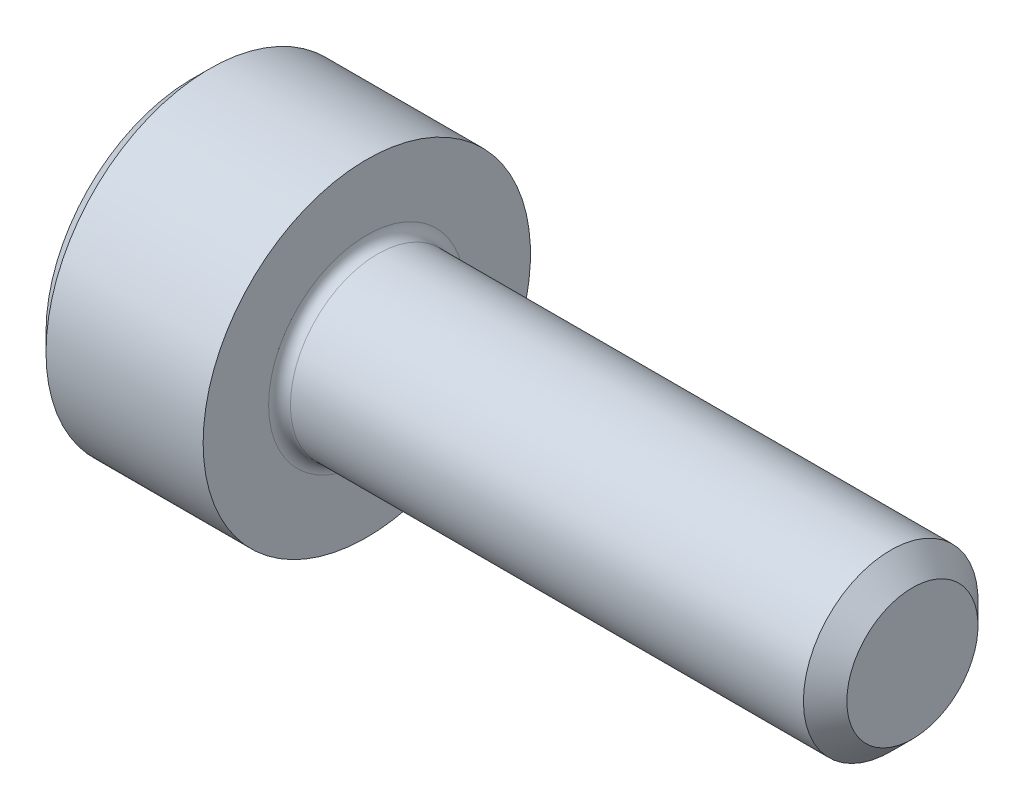
ISO-10303-21;
HEADER;
FILE_DESCRIPTION(('STEP AP214'),'2;1');
FILE_NAME('part.step','',(''),(''),'','','');
FILE_SCHEMA(('AUTOMOTIVE_DESIGN { 1 0 10303 214 1 1 1 1 }'));
ENDSEC;
DATA;
#1=APPLICATION_CONTEXT('core data for automotive mechanical design processes');
#2=APPLICATION_PROTOCOL_DEFINITION('international standard','automotive_design',2000,#1);
#3=PRODUCT_CONTEXT('',#1,'mechanical');
#4=PRODUCT('Part','Part','',(#3));
#5=PRODUCT_RELATED_PRODUCT_CATEGORY('part','',(#4));
#6=PRODUCT_DEFINITION_FORMATION('','',#4);
#7=PRODUCT_DEFINITION_CONTEXT('part definition',#1,'design');
#8=PRODUCT_DEFINITION('design','',#6,#7);
#9=PRODUCT_DEFINITION_SHAPE('','',#8);
#10=(LENGTH_UNIT() NAMED_UNIT(*) SI_UNIT(.MILLI.,.METRE.));
#11=(NAMED_UNIT(*) PLANE_ANGLE_UNIT() SI_UNIT($,.RADIAN.));
#12=(NAMED_UNIT(*) SI_UNIT($,.STERADIAN.) SOLID_ANGLE_UNIT());
#13=UNCERTAINTY_MEASURE_WITH_UNIT(LENGTH_MEASURE(1.E-05),#10,'distance_accuracy_value','');
#14=(GEOMETRIC_REPRESENTATION_CONTEXT(3) GLOBAL_UNCERTAINTY_ASSIGNED_CONTEXT((#13)) GLOBAL_UNIT_ASSIGNED_CONTEXT((#10,
#11,#12)) REPRESENTATION_CONTEXT('',''));
#15=CARTESIAN_POINT('',(0.,0.,0.));
#16=DIRECTION('',(0.,0.,1.));
#17=DIRECTION('',(1.,0.,0.));
#18=AXIS2_PLACEMENT_3D('',#15,#16,#17);
#19=CARTESIAN_POINT('',(0.,0.,0.));
#20=DIRECTION('',(-1.,0.,0.));
#21=DIRECTION('',(0.,0.,1.));
#22=AXIS2_PLACEMENT_3D('',#19,#20,#21);
#23=PLANE('',#22);
#24=DIRECTION('',(0.,-0.499999999999999,0.866025403784439));
#25=VECTOR('',#24,1.);
#26=CARTESIAN_POINT('',(0.,0.892006165897969,0.));
#27=LINE('',#26,#25);
#28=CARTESIAN_POINT('',(0.,0.892006165897969,0.));
#29=VERTEX_POINT('',#28);
#30=CARTESIAN_POINT('',(0.,0.446003082948983,0.772499999999997));
#31=VERTEX_POINT('',#30);
#32=EDGE_CURVE('E257',#29,#31,#27,.T.);
#33=ORIENTED_EDGE('',*,*,#32,.T.);
#34=DIRECTION('',(0.,1.,0.));
#35=VECTOR('',#34,1.);
#36=CARTESIAN_POINT('',(0.,-0.446003082948989,0.772499999999998));
#37=LINE('',#36,#35);
#38=CARTESIAN_POINT('',(0.,-0.446003082948989,0.772499999999998));
#39=VERTEX_POINT('',#38);
#40=EDGE_CURVE('E128',#39,#31,#37,.T.);
#41=ORIENTED_EDGE('',*,*,#40,.F.);
#42=DIRECTION('',(0.,-0.500000000000001,-0.866025403784438));
#43=VECTOR('',#42,1.);
#44=CARTESIAN_POINT('',(0.,-0.446003082948989,0.772499999999998));
#45=LINE('',#44,#43);
#46=CARTESIAN_POINT('',(0.,-0.892006165897975,0.));
#47=VERTEX_POINT('',#46);
#48=EDGE_CURVE('E260',#39,#47,#45,.T.);
#49=ORIENTED_EDGE('',*,*,#48,.T.);
#50=DIRECTION('',(0.,0.499999999999999,-0.866025403784439));
#51=VECTOR('',#50,1.);
#52=CARTESIAN_POINT('',(0.,-0.892006165897975,0.));
#53=LINE('',#52,#51);
#54=CARTESIAN_POINT('',(0.,-0.44600308294899,-0.772500000000001));
#55=VERTEX_POINT('',#54);
#56=EDGE_CURVE('E263',#47,#55,#53,.T.);
#57=ORIENTED_EDGE('',*,*,#56,.T.);
#58=DIRECTION('',(0.,-1.,0.));
#59=VECTOR('',#58,1.);
#60=CARTESIAN_POINT('',(0.,0.446003082948982,-0.772500000000003));
#61=LINE('',#60,#59);
#62=CARTESIAN_POINT('',(0.,0.446003082948982,-0.772500000000003));
#63=VERTEX_POINT('',#62);
#64=EDGE_CURVE('E266',#63,#55,#61,.T.);
#65=ORIENTED_EDGE('',*,*,#64,.F.);
#66=DIRECTION('',(0.,-0.500000000000001,-0.866025403784438));
#67=VECTOR('',#66,1.);
#68=CARTESIAN_POINT('',(0.,0.892006165897969,0.));
#69=LINE('',#68,#67);
#70=EDGE_CURVE('E123',#29,#63,#69,.T.);
#71=ORIENTED_EDGE('',*,*,#70,.F.);
#72=EDGE_LOOP('',(#33,#41,#49,#57,#65,#71));
#73=FACE_BOUND('',#72,.T.);
#74=CARTESIAN_POINT('',(0.,0.,0.));
#75=DIRECTION('',(-1.,0.,0.));
#76=DIRECTION('',(0.,0.,1.));
#77=AXIS2_PLACEMENT_3D('',#74,#75,#76);
#78=CIRCLE('',#77,1.34000000000001);
#79=CARTESIAN_POINT('',(0.,0.,1.34000000000001));
#80=VERTEX_POINT('',#79);
#81=EDGE_CURVE('E152',#80,#80,#78,.T.);
#82=ORIENTED_EDGE('',*,*,#81,.T.);
#83=EDGE_LOOP('',(#82));
#84=FACE_BOUND('',#83,.T.);
#85=ADVANCED_FACE('F32',(#73,#84),#23,.T.);
#86=CARTESIAN_POINT('',(0.,0.,0.));
#87=DIRECTION('',(1.,0.,0.));
#88=DIRECTION('',(0.,0.,-1.));
#89=AXIS2_PLACEMENT_3D('',#86,#87,#88);
#90=CONICAL_SURFACE('',#89,1.34000000000001,0.7853981633974);
#91=CARTESIAN_POINT('',(0.16,0.,0.));
#92=DIRECTION('',(-1.,0.,0.));
#93=DIRECTION('',(0.,0.,1.));
#94=AXIS2_PLACEMENT_3D('',#91,#92,#93);
#95=CIRCLE('',#94,1.5);
#96=CARTESIAN_POINT('',(0.16,0.,1.5));
#97=VERTEX_POINT('',#96);
#98=EDGE_CURVE('E149',#97,#97,#95,.T.);
#99=ORIENTED_EDGE('',*,*,#98,.T.);
#100=EDGE_LOOP('',(#99));
#101=FACE_BOUND('',#100,.T.);
#102=ORIENTED_EDGE('',*,*,#81,.F.);
#103=EDGE_LOOP('',(#102));
#104=FACE_BOUND('',#103,.T.);
#105=ADVANCED_FACE('F173',(#101,#104),#90,.T.);
#106=CARTESIAN_POINT('',(-31.75,0.,0.));
#107=DIRECTION('',(-1.,0.,0.));
#108=DIRECTION('',(0.,0.,1.));
#109=AXIS2_PLACEMENT_3D('',#106,#107,#108);
#110=CYLINDRICAL_SURFACE('',#109,1.5);
#111=CARTESIAN_POINT('',(1.6,0.,0.));
#112=DIRECTION('',(-1.,0.,0.));
#113=DIRECTION('',(0.,0.,1.));
#114=AXIS2_PLACEMENT_3D('',#111,#112,#113);
#115=CIRCLE('',#114,1.5);
#116=CARTESIAN_POINT('',(1.6,0.,1.5));
#117=VERTEX_POINT('',#116);
#118=EDGE_CURVE('E146',#117,#117,#115,.T.);
#119=ORIENTED_EDGE('',*,*,#118,.T.);
#120=EDGE_LOOP('',(#119));
#121=FACE_BOUND('',#120,.T.);
#122=ORIENTED_EDGE('',*,*,#98,.F.);
#123=EDGE_LOOP('',(#122));
#124=FACE_BOUND('',#123,.T.);
#125=ADVANCED_FACE('F178',(#121,#124),#110,.T.);
#126=CARTESIAN_POINT('',(1.6,1.5,0.));
#127=DIRECTION('',(1.,0.,0.));
#128=DIRECTION('',(0.,0.,-1.));
#129=AXIS2_PLACEMENT_3D('',#126,#127,#128);
#130=PLANE('',#129);
#131=CARTESIAN_POINT('',(1.6,0.,0.));
#132=DIRECTION('',(1.,0.,0.));
#133=DIRECTION('',(0.,0.,-1.));
#134=AXIS2_PLACEMENT_3D('',#131,#132,#133);
#135=CIRCLE('',#134,0.900000000000002);
#136=CARTESIAN_POINT('',(1.6,0.,-0.900000000000002));
#137=VERTEX_POINT('',#136);
#138=EDGE_CURVE('E40',#137,#137,#135,.F.);
#139=ORIENTED_EDGE('',*,*,#138,.T.);
#140=EDGE_LOOP('',(#139));
#141=FACE_BOUND('',#140,.T.);
#142=ORIENTED_EDGE('',*,*,#118,.F.);
#143=EDGE_LOOP('',(#142));
#144=FACE_BOUND('',#143,.T.);
#145=ADVANCED_FACE('F157',(#141,#144),#130,.T.);
#146=CARTESIAN_POINT('',(-31.75,0.,0.));
#147=DIRECTION('',(-1.,0.,0.));
#148=DIRECTION('',(0.,0.,1.));
#149=AXIS2_PLACEMENT_3D('',#146,#147,#148);
#150=CYLINDRICAL_SURFACE('',#149,0.800000000000002);
#151=CARTESIAN_POINT('',(1.7,0.,0.));
#152=DIRECTION('',(1.,0.,0.));
#153=DIRECTION('',(0.,0.,-1.));
#154=AXIS2_PLACEMENT_3D('',#151,#152,#153);
#155=CIRCLE('',#154,0.800000000000002);
#156=CARTESIAN_POINT('',(1.7,0.,-0.800000000000002));
#157=VERTEX_POINT('',#156);
#158=EDGE_CURVE('E11',#157,#157,#155,.T.);
#159=ORIENTED_EDGE('',*,*,#158,.T.);
#160=EDGE_LOOP('',(#159));
#161=FACE_BOUND('',#160,.T.);
#162=CARTESIAN_POINT('',(6.401,0.,0.));
#163=DIRECTION('',(-1.,0.,0.));
#164=DIRECTION('',(0.,0.,1.));
#165=AXIS2_PLACEMENT_3D('',#162,#163,#164);
#166=CIRCLE('',#165,0.800000000000002);
#167=CARTESIAN_POINT('',(6.401,0.,0.800000000000002));
#168=VERTEX_POINT('',#167);
#169=EDGE_CURVE('E143',#168,#168,#166,.T.);
#170=ORIENTED_EDGE('',*,*,#169,.T.);
#171=EDGE_LOOP('',(#170));
#172=FACE_BOUND('',#171,.T.);
#173=ADVANCED_FACE('F188',(#161,#172),#150,.T.);
#174=CARTESIAN_POINT('',(6.59999999999999,0.,0.));
#175=DIRECTION('',(-1.,0.,0.));
#176=DIRECTION('',(0.,0.,1.));
#177=AXIS2_PLACEMENT_3D('',#174,#175,#176);
#178=CONICAL_SURFACE('',#177,0.601000000000001,0.785398163397474);
#179=ORIENTED_EDGE('',*,*,#169,.F.);
#180=EDGE_LOOP('',(#179));
#181=FACE_BOUND('',#180,.T.);
#182=CARTESIAN_POINT('',(6.59999999999999,0.,0.));
#183=DIRECTION('',(-1.,0.,0.));
#184=DIRECTION('',(0.,0.,1.));
#185=AXIS2_PLACEMENT_3D('',#182,#183,#184);
#186=CIRCLE('',#185,0.601000000000001);
#187=CARTESIAN_POINT('',(6.59999999999999,0.,0.601000000000001));
#188=VERTEX_POINT('',#187);
#189=EDGE_CURVE('E139',#188,#188,#186,.T.);
#190=ORIENTED_EDGE('',*,*,#189,.T.);
#191=EDGE_LOOP('',(#190));
#192=FACE_BOUND('',#191,.T.);
#193=ADVANCED_FACE('F168',(#181,#192),#178,.T.);
#194=CARTESIAN_POINT('',(6.59999999999999,0.601000000000001,0.));
#195=DIRECTION('',(1.,0.,0.));
#196=DIRECTION('',(0.,0.,-1.));
#197=AXIS2_PLACEMENT_3D('',#194,#195,#196);
#198=PLANE('',#197);
#199=ORIENTED_EDGE('',*,*,#189,.F.);
#200=EDGE_LOOP('',(#199));
#201=FACE_BOUND('',#200,.T.);
#202=ADVANCED_FACE('F161',(#201),#198,.T.);
#203=CARTESIAN_POINT('',(1.7,0.,0.));
#204=DIRECTION('',(1.,0.,0.));
#205=DIRECTION('',(0.,0.,-1.));
#206=AXIS2_PLACEMENT_3D('',#203,#204,#205);
#207=TOROIDAL_SURFACE('',#206,0.900000000000002,0.1);
#208=ORIENTED_EDGE('',*,*,#158,.F.);
#209=EDGE_LOOP('',(#208));
#210=FACE_BOUND('',#209,.T.);
#211=ORIENTED_EDGE('',*,*,#138,.F.);
#212=EDGE_LOOP('',(#211));
#213=FACE_BOUND('',#212,.T.);
#214=ADVANCED_FACE('F34',(#210,#213),#207,.F.);
#215=CARTESIAN_POINT('',(0.7,0.892006165897969,0.));
#216=DIRECTION('',(0.,-0.866025403784439,-0.499999999999999));
#217=DIRECTION('',(0.,0.499999999999999,-0.866025403784439));
#218=AXIS2_PLACEMENT_3D('',#215,#216,#217);
#219=PLANE('',#218);
#220=ORIENTED_EDGE('',*,*,#32,.F.);
#221=DIRECTION('',(-1.,0.,0.));
#222=VECTOR('',#221,1.);
#223=CARTESIAN_POINT('',(0.7,0.892006165897969,0.));
#224=LINE('',#223,#222);
#225=CARTESIAN_POINT('',(0.7,0.892006165897969,0.));
#226=VERTEX_POINT('',#225);
#227=EDGE_CURVE('E247',#226,#29,#224,.T.);
#228=ORIENTED_EDGE('',*,*,#227,.F.);
#229=DIRECTION('',(0.,-0.499999999999999,0.866025403784439));
#230=VECTOR('',#229,1.);
#231=CARTESIAN_POINT('',(0.7,0.892006165897969,0.));
#232=LINE('',#231,#230);
#233=CARTESIAN_POINT('',(0.7,0.669004624423476,0.386249999999998));
#234=VERTEX_POINT('',#233);
#235=EDGE_CURVE('E115',#226,#234,#232,.T.);
#236=ORIENTED_EDGE('',*,*,#235,.T.);
#237=CARTESIAN_POINT('',(0.7,0.446003082948983,0.772499999999997));
#238=VERTEX_POINT('',#237);
#239=EDGE_CURVE('E106',#234,#238,#232,.T.);
#240=ORIENTED_EDGE('',*,*,#239,.T.);
#241=DIRECTION('',(-1.,0.,0.));
#242=VECTOR('',#241,1.);
#243=CARTESIAN_POINT('',(0.7,0.446003082948983,0.772499999999997));
#244=LINE('',#243,#242);
#245=EDGE_CURVE('E120',#238,#31,#244,.T.);
#246=ORIENTED_EDGE('',*,*,#245,.T.);
#247=EDGE_LOOP('',(#220,#228,#236,#240,#246));
#248=FACE_BOUND('',#247,.T.);
#249=ADVANCED_FACE('F119',(#248),#219,.T.);
#250=CARTESIAN_POINT('',(0.7,-0.446003082948989,0.772499999999998));
#251=DIRECTION('',(0.,0.,1.));
#252=DIRECTION('',(0.,-1.,0.));
#253=AXIS2_PLACEMENT_3D('',#250,#251,#252);
#254=PLANE('',#253);
#255=ORIENTED_EDGE('',*,*,#40,.T.);
#256=ORIENTED_EDGE('',*,*,#245,.F.);
#257=DIRECTION('',(0.,1.,0.));
#258=VECTOR('',#257,1.);
#259=CARTESIAN_POINT('',(0.7,-0.446003082948989,0.772499999999998));
#260=LINE('',#259,#258);
#261=CARTESIAN_POINT('',(0.7,0.,0.772499999999998));
#262=VERTEX_POINT('',#261);
#263=EDGE_CURVE('E103',#262,#238,#260,.T.);
#264=ORIENTED_EDGE('',*,*,#263,.F.);
#265=CARTESIAN_POINT('',(0.7,-0.446003082948989,0.772499999999998));
#266=VERTEX_POINT('',#265);
#267=EDGE_CURVE('E114',#266,#262,#260,.T.);
#268=ORIENTED_EDGE('',*,*,#267,.F.);
#269=DIRECTION('',(-1.,0.,0.));
#270=VECTOR('',#269,1.);
#271=CARTESIAN_POINT('',(0.7,-0.446003082948989,0.772499999999998));
#272=LINE('',#271,#270);
#273=EDGE_CURVE('E130',#266,#39,#272,.T.);
#274=ORIENTED_EDGE('',*,*,#273,.T.);
#275=EDGE_LOOP('',(#255,#256,#264,#268,#274));
#276=FACE_BOUND('',#275,.T.);
#277=ADVANCED_FACE('F125',(#276),#254,.F.);
#278=CARTESIAN_POINT('',(0.7,-0.446003082948989,0.772499999999998));
#279=DIRECTION('',(0.,0.866025403784438,-0.500000000000001));
#280=DIRECTION('',(0.,0.500000000000001,0.866025403784438));
#281=AXIS2_PLACEMENT_3D('',#278,#279,#280);
#282=PLANE('',#281);
#283=ORIENTED_EDGE('',*,*,#48,.F.);
#284=ORIENTED_EDGE('',*,*,#273,.F.);
#285=DIRECTION('',(0.,-0.500000000000001,-0.866025403784438));
#286=VECTOR('',#285,1.);
#287=CARTESIAN_POINT('',(0.7,-0.446003082948989,0.772499999999998));
#288=LINE('',#287,#286);
#289=CARTESIAN_POINT('',(0.7,-0.66900462442348,0.386250000000002));
#290=VERTEX_POINT('',#289);
#291=EDGE_CURVE('E286',#266,#290,#288,.T.);
#292=ORIENTED_EDGE('',*,*,#291,.T.);
#293=CARTESIAN_POINT('',(0.7,-0.892006165897975,0.));
#294=VERTEX_POINT('',#293);
#295=EDGE_CURVE('E275',#290,#294,#288,.T.);
#296=ORIENTED_EDGE('',*,*,#295,.T.);
#297=DIRECTION('',(-1.,0.,0.));
#298=VECTOR('',#297,1.);
#299=CARTESIAN_POINT('',(0.7,-0.892006165897975,0.));
#300=LINE('',#299,#298);
#301=EDGE_CURVE('E135',#294,#47,#300,.T.);
#302=ORIENTED_EDGE('',*,*,#301,.T.);
#303=EDGE_LOOP('',(#283,#284,#292,#296,#302));
#304=FACE_BOUND('',#303,.T.);
#305=ADVANCED_FACE('F201',(#304),#282,.T.);
#306=CARTESIAN_POINT('',(0.7,-0.892006165897975,0.));
#307=DIRECTION('',(0.,0.866025403784439,0.499999999999999));
#308=DIRECTION('',(0.,-0.5,0.866025403784439));
#309=AXIS2_PLACEMENT_3D('',#306,#307,#308);
#310=PLANE('',#309);
#311=ORIENTED_EDGE('',*,*,#56,.F.);
#312=ORIENTED_EDGE('',*,*,#301,.F.);
#313=DIRECTION('',(0.,0.499999999999999,-0.866025403784439));
#314=VECTOR('',#313,1.);
#315=CARTESIAN_POINT('',(0.7,-0.892006165897975,0.));
#316=LINE('',#315,#314);
#317=CARTESIAN_POINT('',(0.7,-0.669004624423482,-0.386250000000001));
#318=VERTEX_POINT('',#317);
#319=EDGE_CURVE('E253',#294,#318,#316,.T.);
#320=ORIENTED_EDGE('',*,*,#319,.T.);
#321=CARTESIAN_POINT('',(0.7,-0.44600308294899,-0.772500000000001));
#322=VERTEX_POINT('',#321);
#323=EDGE_CURVE('E285',#318,#322,#316,.T.);
#324=ORIENTED_EDGE('',*,*,#323,.T.);
#325=DIRECTION('',(-1.,0.,0.));
#326=VECTOR('',#325,1.);
#327=CARTESIAN_POINT('',(0.7,-0.44600308294899,-0.772500000000001));
#328=LINE('',#327,#326);
#329=EDGE_CURVE('E246',#322,#55,#328,.T.);
#330=ORIENTED_EDGE('',*,*,#329,.T.);
#331=EDGE_LOOP('',(#311,#312,#320,#324,#330));
#332=FACE_BOUND('',#331,.T.);
#333=ADVANCED_FACE('F204',(#332),#310,.T.);
#334=CARTESIAN_POINT('',(0.7,0.446003082948982,-0.772500000000003));
#335=DIRECTION('',(0.,0.,-1.));
#336=DIRECTION('',(0.,1.,0.));
#337=AXIS2_PLACEMENT_3D('',#334,#335,#336);
#338=PLANE('',#337);
#339=ORIENTED_EDGE('',*,*,#64,.T.);
#340=ORIENTED_EDGE('',*,*,#329,.F.);
#341=DIRECTION('',(0.,-1.,0.));
#342=VECTOR('',#341,1.);
#343=CARTESIAN_POINT('',(0.7,0.446003082948982,-0.772500000000003));
#344=LINE('',#343,#342);
#345=CARTESIAN_POINT('',(0.700000000000004,0.,-0.772500000000001));
#346=VERTEX_POINT('',#345);
#347=EDGE_CURVE('E250',#346,#322,#344,.T.);
#348=ORIENTED_EDGE('',*,*,#347,.F.);
#349=CARTESIAN_POINT('',(0.7,0.446003082948982,-0.772500000000003));
#350=VERTEX_POINT('',#349);
#351=EDGE_CURVE('E47',#350,#346,#344,.T.);
#352=ORIENTED_EDGE('',*,*,#351,.F.);
#353=DIRECTION('',(-1.,0.,0.));
#354=VECTOR('',#353,1.);
#355=CARTESIAN_POINT('',(0.7,0.446003082948982,-0.772500000000003));
#356=LINE('',#355,#354);
#357=EDGE_CURVE('E243',#350,#63,#356,.T.);
#358=ORIENTED_EDGE('',*,*,#357,.T.);
#359=EDGE_LOOP('',(#339,#340,#348,#352,#358));
#360=FACE_BOUND('',#359,.T.);
#361=ADVANCED_FACE('F208',(#360),#338,.F.);
#362=CARTESIAN_POINT('',(0.7,0.892006165897969,0.));
#363=DIRECTION('',(0.,0.866025403784438,-0.500000000000001));
#364=DIRECTION('',(0.,0.500000000000001,0.866025403784438));
#365=AXIS2_PLACEMENT_3D('',#362,#363,#364);
#366=PLANE('',#365);
#367=ORIENTED_EDGE('',*,*,#70,.T.);
#368=ORIENTED_EDGE('',*,*,#357,.F.);
#369=DIRECTION('',(0.,-0.500000000000001,-0.866025403784438));
#370=VECTOR('',#369,1.);
#371=CARTESIAN_POINT('',(0.7,0.892006165897969,0.));
#372=LINE('',#371,#370);
#373=CARTESIAN_POINT('',(0.7,0.669004624423477,-0.38625));
#374=VERTEX_POINT('',#373);
#375=EDGE_CURVE('E233',#374,#350,#372,.T.);
#376=ORIENTED_EDGE('',*,*,#375,.F.);
#377=EDGE_CURVE('E239',#226,#374,#372,.T.);
#378=ORIENTED_EDGE('',*,*,#377,.F.);
#379=ORIENTED_EDGE('',*,*,#227,.T.);
#380=EDGE_LOOP('',(#367,#368,#376,#378,#379));
#381=FACE_BOUND('',#380,.T.);
#382=ADVANCED_FACE('F212',(#381),#366,.F.);
#383=CARTESIAN_POINT('',(0.7,0.,1.545));
#384=DIRECTION('',(1.,0.,0.));
#385=DIRECTION('',(0.,0.,-1.));
#386=AXIS2_PLACEMENT_3D('',#383,#384,#385);
#387=PLANE('',#386);
#388=ORIENTED_EDGE('',*,*,#347,.T.);
#389=ORIENTED_EDGE('',*,*,#323,.F.);
#390=CARTESIAN_POINT('',(0.700000000000004,0.,0.));
#391=DIRECTION('',(-1.,0.,0.));
#392=DIRECTION('',(0.,0.,1.));
#393=AXIS2_PLACEMENT_3D('',#390,#391,#392);
#394=CIRCLE('',#393,0.772500000000001);
#395=EDGE_CURVE('E281',#346,#318,#394,.T.);
#396=ORIENTED_EDGE('',*,*,#395,.F.);
#397=EDGE_LOOP('',(#388,#389,#396));
#398=FACE_BOUND('',#397,.T.);
#399=ADVANCED_FACE('F216',(#398),#387,.F.);
#400=ORIENTED_EDGE('',*,*,#319,.F.);
#401=ORIENTED_EDGE('',*,*,#295,.F.);
#402=EDGE_CURVE('E133',#318,#290,#394,.T.);
#403=ORIENTED_EDGE('',*,*,#402,.F.);
#404=EDGE_LOOP('',(#400,#401,#403));
#405=FACE_BOUND('',#404,.T.);
#406=ADVANCED_FACE('F219',(#405),#387,.F.);
#407=ORIENTED_EDGE('',*,*,#291,.F.);
#408=ORIENTED_EDGE('',*,*,#267,.T.);
#409=EDGE_CURVE('E129',#290,#262,#394,.T.);
#410=ORIENTED_EDGE('',*,*,#409,.F.);
#411=EDGE_LOOP('',(#407,#408,#410));
#412=FACE_BOUND('',#411,.T.);
#413=ADVANCED_FACE('F224',(#412),#387,.F.);
#414=ORIENTED_EDGE('',*,*,#263,.T.);
#415=ORIENTED_EDGE('',*,*,#239,.F.);
#416=EDGE_CURVE('E109',#262,#234,#394,.T.);
#417=ORIENTED_EDGE('',*,*,#416,.F.);
#418=EDGE_LOOP('',(#414,#415,#417));
#419=FACE_BOUND('',#418,.T.);
#420=ADVANCED_FACE('F105',(#419),#387,.F.);
#421=ORIENTED_EDGE('',*,*,#235,.F.);
#422=ORIENTED_EDGE('',*,*,#377,.T.);
#423=EDGE_CURVE('E140',#234,#374,#394,.T.);
#424=ORIENTED_EDGE('',*,*,#423,.F.);
#425=EDGE_LOOP('',(#421,#422,#424));
#426=FACE_BOUND('',#425,.T.);
#427=ADVANCED_FACE('F227',(#426),#387,.F.);
#428=ORIENTED_EDGE('',*,*,#375,.T.);
#429=ORIENTED_EDGE('',*,*,#351,.T.);
#430=EDGE_CURVE('E236',#374,#346,#394,.T.);
#431=ORIENTED_EDGE('',*,*,#430,.F.);
#432=EDGE_LOOP('',(#428,#429,#431));
#433=FACE_BOUND('',#432,.T.);
#434=ADVANCED_FACE('F197',(#433),#387,.F.);
#435=CARTESIAN_POINT('',(0.700000000000004,0.,0.));
#436=DIRECTION('',(-1.,0.,0.));
#437=DIRECTION('',(0.,0.,1.));
#438=AXIS2_PLACEMENT_3D('',#435,#436,#437);
#439=CONICAL_SURFACE('',#438,0.772500000000001,1.04719755119659);
#440=CARTESIAN_POINT('',(1.146003082949,0.,0.));
#441=VERTEX_POINT('',#440);
#442=VERTEX_LOOP('',#441);
#443=FACE_BOUND('',#442,.T.);
#444=ORIENTED_EDGE('',*,*,#416,.T.);
#445=ORIENTED_EDGE('',*,*,#423,.T.);
#446=ORIENTED_EDGE('',*,*,#430,.T.);
#447=ORIENTED_EDGE('',*,*,#395,.T.);
#448=ORIENTED_EDGE('',*,*,#402,.T.);
#449=ORIENTED_EDGE('',*,*,#409,.T.);
#450=EDGE_LOOP('',(#444,#445,#446,#447,#448,#449));
#451=FACE_BOUND('',#450,.T.);
#452=ADVANCED_FACE('F195',(#443,#451),#439,.F.);
#453=CLOSED_SHELL('',(#85,#105,#125,#145,#173,#193,#202,#214,#249,#277,#305,#333,#361,#382,#399,
#406,#413,#420,#427,#434,#452));
#454=MANIFOLD_SOLID_BREP('B2',#453);
#455=ADVANCED_BREP_SHAPE_REPRESENTATION('',(#18,#454),#14);
#456=SHAPE_DEFINITION_REPRESENTATION(#9,#455);
ENDSEC;
END-ISO-10303-21;
